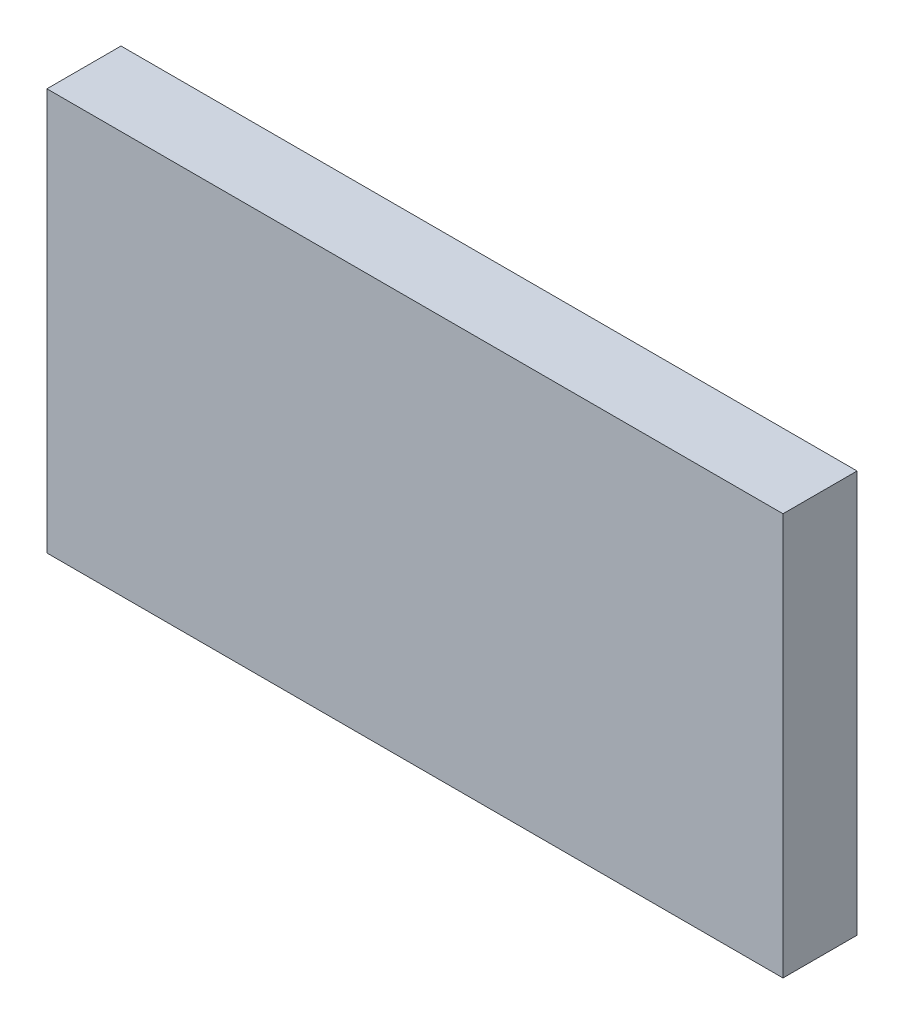
ISO-10303-21;
HEADER;
FILE_DESCRIPTION(('STEP AP214'),'2;1');
FILE_NAME('part.step','',(''),(''),'','','');
FILE_SCHEMA(('AUTOMOTIVE_DESIGN { 1 0 10303 214 1 1 1 1 }'));
ENDSEC;
DATA;
#1=APPLICATION_CONTEXT('core data for automotive mechanical design processes');
#2=APPLICATION_PROTOCOL_DEFINITION('international standard','automotive_design',2000,#1);
#3=PRODUCT_CONTEXT('',#1,'mechanical');
#4=PRODUCT('Part','Part','',(#3));
#5=PRODUCT_RELATED_PRODUCT_CATEGORY('part','',(#4));
#6=PRODUCT_DEFINITION_FORMATION('','',#4);
#7=PRODUCT_DEFINITION_CONTEXT('part definition',#1,'design');
#8=PRODUCT_DEFINITION('design','',#6,#7);
#9=PRODUCT_DEFINITION_SHAPE('','',#8);
#10=(LENGTH_UNIT() NAMED_UNIT(*) SI_UNIT(.MILLI.,.METRE.));
#11=(NAMED_UNIT(*) PLANE_ANGLE_UNIT() SI_UNIT($,.RADIAN.));
#12=(NAMED_UNIT(*) SI_UNIT($,.STERADIAN.) SOLID_ANGLE_UNIT());
#13=UNCERTAINTY_MEASURE_WITH_UNIT(LENGTH_MEASURE(1.E-05),#10,'distance_accuracy_value','');
#14=(GEOMETRIC_REPRESENTATION_CONTEXT(3) GLOBAL_UNCERTAINTY_ASSIGNED_CONTEXT((#13)) GLOBAL_UNIT_ASSIGNED_CONTEXT((#10,
#11,#12)) REPRESENTATION_CONTEXT('',''));
#15=CARTESIAN_POINT('',(0.,0.,0.));
#16=DIRECTION('',(0.,0.,1.));
#17=DIRECTION('',(1.,0.,0.));
#18=AXIS2_PLACEMENT_3D('',#15,#16,#17);
#19=CARTESIAN_POINT('',(76.962,42.037,-4.986));
#20=DIRECTION('',(1.,0.,0.));
#21=DIRECTION('',(0.,0.,-1.));
#22=AXIS2_PLACEMENT_3D('',#19,#20,#21);
#23=PLANE('',#22);
#24=DIRECTION('',(0.,0.,1.));
#25=VECTOR('',#24,1.);
#26=CARTESIAN_POINT('',(76.962,42.037,-4.986));
#27=LINE('',#26,#25);
#28=CARTESIAN_POINT('',(76.962,42.037,-4.986));
#29=VERTEX_POINT('',#28);
#30=CARTESIAN_POINT('',(76.962,42.037,10.508));
#31=VERTEX_POINT('',#30);
#32=EDGE_CURVE('E50',#29,#31,#27,.T.);
#33=ORIENTED_EDGE('',*,*,#32,.T.);
#34=DIRECTION('',(0.,1.,0.));
#35=VECTOR('',#34,1.);
#36=CARTESIAN_POINT('',(76.962,42.037,10.508));
#37=LINE('',#36,#35);
#38=CARTESIAN_POINT('',(76.962,-42.037,10.508));
#39=VERTEX_POINT('',#38);
#40=EDGE_CURVE('E87',#39,#31,#37,.T.);
#41=ORIENTED_EDGE('',*,*,#40,.F.);
#42=DIRECTION('',(0.,0.,1.));
#43=VECTOR('',#42,1.);
#44=CARTESIAN_POINT('',(76.962,-42.037,-4.986));
#45=LINE('',#44,#43);
#46=CARTESIAN_POINT('',(76.962,-42.037,-4.986));
#47=VERTEX_POINT('',#46);
#48=EDGE_CURVE('E12',#47,#39,#45,.T.);
#49=ORIENTED_EDGE('',*,*,#48,.F.);
#50=DIRECTION('',(0.,1.,0.));
#51=VECTOR('',#50,1.);
#52=CARTESIAN_POINT('',(76.962,42.037,-4.986));
#53=LINE('',#52,#51);
#54=EDGE_CURVE('E88',#47,#29,#53,.T.);
#55=ORIENTED_EDGE('',*,*,#54,.T.);
#56=EDGE_LOOP('',(#33,#41,#49,#55));
#57=FACE_BOUND('',#56,.T.);
#58=ADVANCED_FACE('F47',(#57),#23,.T.);
#59=CARTESIAN_POINT('',(-76.962,-42.037,-4.986));
#60=DIRECTION('',(0.,-1.,0.));
#61=DIRECTION('',(0.,0.,-1.));
#62=AXIS2_PLACEMENT_3D('',#59,#60,#61);
#63=PLANE('',#62);
#64=ORIENTED_EDGE('',*,*,#48,.T.);
#65=DIRECTION('',(1.,0.,0.));
#66=VECTOR('',#65,1.);
#67=CARTESIAN_POINT('',(-76.962,-42.037,10.508));
#68=LINE('',#67,#66);
#69=CARTESIAN_POINT('',(-76.962,-42.037,10.508));
#70=VERTEX_POINT('',#69);
#71=EDGE_CURVE('E104',#70,#39,#68,.T.);
#72=ORIENTED_EDGE('',*,*,#71,.F.);
#73=DIRECTION('',(0.,0.,1.));
#74=VECTOR('',#73,1.);
#75=CARTESIAN_POINT('',(-76.962,-42.037,-4.986));
#76=LINE('',#75,#74);
#77=CARTESIAN_POINT('',(-76.962,-42.037,-4.986));
#78=VERTEX_POINT('',#77);
#79=EDGE_CURVE('E55',#78,#70,#76,.T.);
#80=ORIENTED_EDGE('',*,*,#79,.F.);
#81=DIRECTION('',(1.,0.,0.));
#82=VECTOR('',#81,1.);
#83=CARTESIAN_POINT('',(-76.962,-42.037,-4.986));
#84=LINE('',#83,#82);
#85=EDGE_CURVE('E93',#78,#47,#84,.T.);
#86=ORIENTED_EDGE('',*,*,#85,.T.);
#87=EDGE_LOOP('',(#64,#72,#80,#86));
#88=FACE_BOUND('',#87,.T.);
#89=ADVANCED_FACE('F119',(#88),#63,.T.);
#90=CARTESIAN_POINT('',(-76.962,42.037,-4.986));
#91=DIRECTION('',(-1.,0.,0.));
#92=DIRECTION('',(0.,0.,1.));
#93=AXIS2_PLACEMENT_3D('',#90,#91,#92);
#94=PLANE('',#93);
#95=ORIENTED_EDGE('',*,*,#79,.T.);
#96=DIRECTION('',(0.,-1.,0.));
#97=VECTOR('',#96,1.);
#98=CARTESIAN_POINT('',(-76.962,42.037,10.508));
#99=LINE('',#98,#97);
#100=CARTESIAN_POINT('',(-76.962,42.037,10.508));
#101=VERTEX_POINT('',#100);
#102=EDGE_CURVE('E100',#101,#70,#99,.T.);
#103=ORIENTED_EDGE('',*,*,#102,.F.);
#104=DIRECTION('',(0.,0.,1.));
#105=VECTOR('',#104,1.);
#106=CARTESIAN_POINT('',(-76.962,42.037,-4.986));
#107=LINE('',#106,#105);
#108=CARTESIAN_POINT('',(-76.962,42.037,-4.986));
#109=VERTEX_POINT('',#108);
#110=EDGE_CURVE('E92',#109,#101,#107,.T.);
#111=ORIENTED_EDGE('',*,*,#110,.F.);
#112=DIRECTION('',(0.,-1.,0.));
#113=VECTOR('',#112,1.);
#114=CARTESIAN_POINT('',(-76.962,42.037,-4.986));
#115=LINE('',#114,#113);
#116=EDGE_CURVE('E112',#109,#78,#115,.T.);
#117=ORIENTED_EDGE('',*,*,#116,.T.);
#118=EDGE_LOOP('',(#95,#103,#111,#117));
#119=FACE_BOUND('',#118,.T.);
#120=ADVANCED_FACE('F116',(#119),#94,.T.);
#121=CARTESIAN_POINT('',(-76.962,42.037,-4.986));
#122=DIRECTION('',(0.,1.,0.));
#123=DIRECTION('',(0.,0.,1.));
#124=AXIS2_PLACEMENT_3D('',#121,#122,#123);
#125=PLANE('',#124);
#126=ORIENTED_EDGE('',*,*,#110,.T.);
#127=DIRECTION('',(-1.,0.,0.));
#128=VECTOR('',#127,1.);
#129=CARTESIAN_POINT('',(-76.962,42.037,10.508));
#130=LINE('',#129,#128);
#131=EDGE_CURVE('E95',#31,#101,#130,.T.);
#132=ORIENTED_EDGE('',*,*,#131,.F.);
#133=ORIENTED_EDGE('',*,*,#32,.F.);
#134=DIRECTION('',(-1.,0.,0.));
#135=VECTOR('',#134,1.);
#136=CARTESIAN_POINT('',(-76.962,42.037,-4.986));
#137=LINE('',#136,#135);
#138=EDGE_CURVE('E110',#29,#109,#137,.T.);
#139=ORIENTED_EDGE('',*,*,#138,.T.);
#140=EDGE_LOOP('',(#126,#132,#133,#139));
#141=FACE_BOUND('',#140,.T.);
#142=ADVANCED_FACE('F96',(#141),#125,.T.);
#143=CARTESIAN_POINT('',(0.,0.,-4.986));
#144=DIRECTION('',(0.,0.,1.));
#145=DIRECTION('',(1.,0.,0.));
#146=AXIS2_PLACEMENT_3D('',#143,#144,#145);
#147=PLANE('',#146);
#148=ORIENTED_EDGE('',*,*,#54,.F.);
#149=ORIENTED_EDGE('',*,*,#85,.F.);
#150=ORIENTED_EDGE('',*,*,#116,.F.);
#151=ORIENTED_EDGE('',*,*,#138,.F.);
#152=EDGE_LOOP('',(#148,#149,#150,#151));
#153=FACE_BOUND('',#152,.T.);
#154=ADVANCED_FACE('F121',(#153),#147,.F.);
#155=CARTESIAN_POINT('',(0.,0.,10.508));
#156=DIRECTION('',(0.,0.,1.));
#157=DIRECTION('',(1.,0.,0.));
#158=AXIS2_PLACEMENT_3D('',#155,#156,#157);
#159=PLANE('',#158);
#160=ORIENTED_EDGE('',*,*,#40,.T.);
#161=ORIENTED_EDGE('',*,*,#131,.T.);
#162=ORIENTED_EDGE('',*,*,#102,.T.);
#163=ORIENTED_EDGE('',*,*,#71,.T.);
#164=EDGE_LOOP('',(#160,#161,#162,#163));
#165=FACE_BOUND('',#164,.T.);
#166=ADVANCED_FACE('F103',(#165),#159,.T.);
#167=CLOSED_SHELL('',(#58,#89,#120,#142,#154,#166));
#168=MANIFOLD_SOLID_BREP('B2_NOT_SHOWN',#167);
#169=CARTESIAN_POINT('',(75.,40.,10.));
#170=DIRECTION('',(-1.,0.,0.));
#171=DIRECTION('',(0.,0.,1.));
#172=AXIS2_PLACEMENT_3D('',#169,#170,#171);
#173=PLANE('',#172);
#174=DIRECTION('',(0.,1.,0.));
#175=VECTOR('',#174,1.);
#176=CARTESIAN_POINT('',(75.,40.,10.));
#177=LINE('',#176,#175);
#178=CARTESIAN_POINT('',(75.,-37.,10.));
#179=VERTEX_POINT('',#178);
#180=CARTESIAN_POINT('',(75.,37.,10.));
#181=VERTEX_POINT('',#180);
#182=EDGE_CURVE('E349',#179,#181,#177,.T.);
#183=ORIENTED_EDGE('',*,*,#182,.F.);
#184=DIRECTION('',(0.,0.,-1.));
#185=VECTOR('',#184,1.);
#186=CARTESIAN_POINT('',(75.,-37.,10.));
#187=LINE('',#186,#185);
#188=CARTESIAN_POINT('',(75.,-37.,0.));
#189=VERTEX_POINT('',#188);
#190=EDGE_CURVE('E334',#179,#189,#187,.T.);
#191=ORIENTED_EDGE('',*,*,#190,.T.);
#192=DIRECTION('',(0.,1.,0.));
#193=VECTOR('',#192,1.);
#194=CARTESIAN_POINT('',(75.,40.,0.));
#195=LINE('',#194,#193);
#196=CARTESIAN_POINT('',(75.,37.,0.));
#197=VERTEX_POINT('',#196);
#198=EDGE_CURVE('E346',#189,#197,#195,.T.);
#199=ORIENTED_EDGE('',*,*,#198,.T.);
#200=DIRECTION('',(0.,0.,-1.));
#201=VECTOR('',#200,1.);
#202=CARTESIAN_POINT('',(75.,37.,10.));
#203=LINE('',#202,#201);
#204=EDGE_CURVE('E351',#197,#181,#203,.F.);
#205=ORIENTED_EDGE('',*,*,#204,.T.);
#206=EDGE_LOOP('',(#183,#191,#199,#205));
#207=FACE_BOUND('',#206,.T.);
#208=ADVANCED_FACE('F170',(#207),#173,.F.);
#209=CARTESIAN_POINT('',(-75.,40.,10.));
#210=DIRECTION('',(0.,-1.,0.));
#211=DIRECTION('',(0.,0.,-1.));
#212=AXIS2_PLACEMENT_3D('',#209,#210,#211);
#213=PLANE('',#212);
#214=DIRECTION('',(-1.,0.,0.));
#215=VECTOR('',#214,1.);
#216=CARTESIAN_POINT('',(-75.,40.,10.));
#217=LINE('',#216,#215);
#218=CARTESIAN_POINT('',(72.,40.,10.));
#219=VERTEX_POINT('',#218);
#220=CARTESIAN_POINT('',(-72.,40.,10.));
#221=VERTEX_POINT('',#220);
#222=EDGE_CURVE('E549',#219,#221,#217,.T.);
#223=ORIENTED_EDGE('',*,*,#222,.F.);
#224=DIRECTION('',(0.,0.,-1.));
#225=VECTOR('',#224,1.);
#226=CARTESIAN_POINT('',(72.,40.,10.));
#227=LINE('',#226,#225);
#228=CARTESIAN_POINT('',(72.,40.,0.));
#229=VERTEX_POINT('',#228);
#230=EDGE_CURVE('E390',#219,#229,#227,.T.);
#231=ORIENTED_EDGE('',*,*,#230,.T.);
#232=DIRECTION('',(-1.,0.,0.));
#233=VECTOR('',#232,1.);
#234=CARTESIAN_POINT('',(-75.,40.,0.));
#235=LINE('',#234,#233);
#236=CARTESIAN_POINT('',(-72.,40.,0.));
#237=VERTEX_POINT('',#236);
#238=EDGE_CURVE('E355',#229,#237,#235,.T.);
#239=ORIENTED_EDGE('',*,*,#238,.T.);
#240=DIRECTION('',(0.,0.,-1.));
#241=VECTOR('',#240,1.);
#242=CARTESIAN_POINT('',(-72.,40.,10.));
#243=LINE('',#242,#241);
#244=EDGE_CURVE('E388',#237,#221,#243,.F.);
#245=ORIENTED_EDGE('',*,*,#244,.T.);
#246=EDGE_LOOP('',(#223,#231,#239,#245));
#247=FACE_BOUND('',#246,.T.);
#248=ADVANCED_FACE('F574',(#247),#213,.F.);
#249=CARTESIAN_POINT('',(-75.,40.,10.));
#250=DIRECTION('',(1.,0.,0.));
#251=DIRECTION('',(0.,1.,0.));
#252=AXIS2_PLACEMENT_3D('',#249,#250,#251);
#253=PLANE('',#252);
#254=DIRECTION('',(0.,-1.,0.));
#255=VECTOR('',#254,1.);
#256=CARTESIAN_POINT('',(-75.,40.,10.));
#257=LINE('',#256,#255);
#258=CARTESIAN_POINT('',(-75.,37.,10.));
#259=VERTEX_POINT('',#258);
#260=CARTESIAN_POINT('',(-75.,-37.,10.));
#261=VERTEX_POINT('',#260);
#262=EDGE_CURVE('E551',#259,#261,#257,.T.);
#263=ORIENTED_EDGE('',*,*,#262,.F.);
#264=DIRECTION('',(0.,0.,-1.));
#265=VECTOR('',#264,1.);
#266=CARTESIAN_POINT('',(-75.,37.,10.));
#267=LINE('',#266,#265);
#268=CARTESIAN_POINT('',(-75.,37.,0.));
#269=VERTEX_POINT('',#268);
#270=EDGE_CURVE('E395',#259,#269,#267,.T.);
#271=ORIENTED_EDGE('',*,*,#270,.T.);
#272=DIRECTION('',(0.,-1.,0.));
#273=VECTOR('',#272,1.);
#274=CARTESIAN_POINT('',(-75.,40.,0.));
#275=LINE('',#274,#273);
#276=CARTESIAN_POINT('',(-75.,-37.,0.));
#277=VERTEX_POINT('',#276);
#278=EDGE_CURVE('E359',#269,#277,#275,.T.);
#279=ORIENTED_EDGE('',*,*,#278,.T.);
#280=DIRECTION('',(0.,0.,-1.));
#281=VECTOR('',#280,1.);
#282=CARTESIAN_POINT('',(-75.,-37.,10.));
#283=LINE('',#282,#281);
#284=EDGE_CURVE('E393',#277,#261,#283,.F.);
#285=ORIENTED_EDGE('',*,*,#284,.T.);
#286=EDGE_LOOP('',(#263,#271,#279,#285));
#287=FACE_BOUND('',#286,.T.);
#288=ADVANCED_FACE('F566',(#287),#253,.F.);
#289=CARTESIAN_POINT('',(-75.,-40.,10.));
#290=DIRECTION('',(0.,1.,0.));
#291=DIRECTION('',(0.,0.,1.));
#292=AXIS2_PLACEMENT_3D('',#289,#290,#291);
#293=PLANE('',#292);
#294=DIRECTION('',(1.,0.,0.));
#295=VECTOR('',#294,1.);
#296=CARTESIAN_POINT('',(-75.,-40.,0.));
#297=LINE('',#296,#295);
#298=CARTESIAN_POINT('',(-72.,-40.,0.));
#299=VERTEX_POINT('',#298);
#300=CARTESIAN_POINT('',(72.,-40.,0.));
#301=VERTEX_POINT('',#300);
#302=EDGE_CURVE('E370',#299,#301,#297,.T.);
#303=ORIENTED_EDGE('',*,*,#302,.T.);
#304=DIRECTION('',(0.,0.,-1.));
#305=VECTOR('',#304,1.);
#306=CARTESIAN_POINT('',(72.,-40.,10.));
#307=LINE('',#306,#305);
#308=CARTESIAN_POINT('',(72.,-40.,10.));
#309=VERTEX_POINT('',#308);
#310=EDGE_CURVE('E335',#301,#309,#307,.F.);
#311=ORIENTED_EDGE('',*,*,#310,.T.);
#312=DIRECTION('',(1.,0.,0.));
#313=VECTOR('',#312,1.);
#314=CARTESIAN_POINT('',(-75.,-40.,10.));
#315=LINE('',#314,#313);
#316=CARTESIAN_POINT('',(-72.,-40.,10.));
#317=VERTEX_POINT('',#316);
#318=EDGE_CURVE('E365',#317,#309,#315,.T.);
#319=ORIENTED_EDGE('',*,*,#318,.F.);
#320=DIRECTION('',(0.,0.,-1.));
#321=VECTOR('',#320,1.);
#322=CARTESIAN_POINT('',(-72.,-40.,10.));
#323=LINE('',#322,#321);
#324=EDGE_CURVE('E340',#317,#299,#323,.T.);
#325=ORIENTED_EDGE('',*,*,#324,.T.);
#326=EDGE_LOOP('',(#303,#311,#319,#325));
#327=FACE_BOUND('',#326,.T.);
#328=ADVANCED_FACE('F560',(#327),#293,.F.);
#329=CARTESIAN_POINT('',(0.,0.,10.));
#330=DIRECTION('',(0.,0.,1.));
#331=DIRECTION('',(1.,0.,0.));
#332=AXIS2_PLACEMENT_3D('',#329,#330,#331);
#333=PLANE('',#332);
#334=CARTESIAN_POINT('',(-70.,35.,10.));
#335=DIRECTION('',(0.,0.,-1.));
#336=DIRECTION('',(-1.,0.,0.));
#337=AXIS2_PLACEMENT_3D('',#334,#335,#336);
#338=CIRCLE('',#337,11.);
#339=CARTESIAN_POINT('',(-59.5431354294488,31.5862068965517,10.));
#340=VERTEX_POINT('',#339);
#341=CARTESIAN_POINT('',(-66.5862068965517,24.5431354294488,10.));
#342=VERTEX_POINT('',#341);
#343=EDGE_CURVE('E469',#340,#342,#338,.T.);
#344=ORIENTED_EDGE('',*,*,#343,.F.);
#345=CARTESIAN_POINT('',(-56.2159512479098,30.5,10.));
#346=DIRECTION('',(0.,0.,1.));
#347=DIRECTION('',(1.,0.,0.));
#348=AXIS2_PLACEMENT_3D('',#345,#346,#347);
#349=CIRCLE('',#348,3.5);
#350=CARTESIAN_POINT('',(-56.2159512479098,34.,10.));
#351=VERTEX_POINT('',#350);
#352=EDGE_CURVE('E178',#340,#351,#349,.F.);
#353=ORIENTED_EDGE('',*,*,#352,.T.);
#354=DIRECTION('',(-1.,0.,0.));
#355=VECTOR('',#354,1.);
#356=CARTESIAN_POINT('',(-59.0455488498967,34.,10.));
#357=LINE('',#356,#355);
#358=CARTESIAN_POINT('',(56.2159512479097,34.,10.));
#359=VERTEX_POINT('',#358);
#360=EDGE_CURVE('E468',#359,#351,#357,.T.);
#361=ORIENTED_EDGE('',*,*,#360,.F.);
#362=CARTESIAN_POINT('',(56.2159512479098,30.5,10.));
#363=DIRECTION('',(0.,0.,1.));
#364=DIRECTION('',(1.,0.,0.));
#365=AXIS2_PLACEMENT_3D('',#362,#363,#364);
#366=CIRCLE('',#365,3.5);
#367=CARTESIAN_POINT('',(59.5431354294488,31.5862068965517,10.));
#368=VERTEX_POINT('',#367);
#369=EDGE_CURVE('E463',#359,#368,#366,.F.);
#370=ORIENTED_EDGE('',*,*,#369,.T.);
#371=CARTESIAN_POINT('',(70.,35.,10.));
#372=DIRECTION('',(0.,0.,-1.));
#373=DIRECTION('',(1.,0.,0.));
#374=AXIS2_PLACEMENT_3D('',#371,#372,#373);
#375=CIRCLE('',#374,11.);
#376=CARTESIAN_POINT('',(66.5862068965517,24.5431354294488,10.));
#377=VERTEX_POINT('',#376);
#378=EDGE_CURVE('E476',#377,#368,#375,.T.);
#379=ORIENTED_EDGE('',*,*,#378,.F.);
#380=CARTESIAN_POINT('',(65.5,21.2159512479098,10.));
#381=DIRECTION('',(0.,0.,1.));
#382=DIRECTION('',(1.,0.,0.));
#383=AXIS2_PLACEMENT_3D('',#380,#381,#382);
#384=CIRCLE('',#383,3.5);
#385=CARTESIAN_POINT('',(69.,21.2159512479098,10.));
#386=VERTEX_POINT('',#385);
#387=EDGE_CURVE('E461',#377,#386,#384,.F.);
#388=ORIENTED_EDGE('',*,*,#387,.T.);
#389=DIRECTION('',(0.,1.,0.));
#390=VECTOR('',#389,1.);
#391=CARTESIAN_POINT('',(69.,24.0455488498967,10.));
#392=LINE('',#391,#390);
#393=CARTESIAN_POINT('',(69.,-21.2159512479098,10.));
#394=VERTEX_POINT('',#393);
#395=EDGE_CURVE('E524',#394,#386,#392,.T.);
#396=ORIENTED_EDGE('',*,*,#395,.F.);
#397=CARTESIAN_POINT('',(65.5,-21.2159512479098,10.));
#398=DIRECTION('',(0.,0.,1.));
#399=DIRECTION('',(1.,0.,0.));
#400=AXIS2_PLACEMENT_3D('',#397,#398,#399);
#401=CIRCLE('',#400,3.5);
#402=CARTESIAN_POINT('',(66.5862068965517,-24.5431354294488,10.));
#403=VERTEX_POINT('',#402);
#404=EDGE_CURVE('E459',#394,#403,#401,.F.);
#405=ORIENTED_EDGE('',*,*,#404,.T.);
#406=CARTESIAN_POINT('',(70.,-35.,10.));
#407=DIRECTION('',(0.,0.,-1.));
#408=DIRECTION('',(1.,0.,0.));
#409=AXIS2_PLACEMENT_3D('',#406,#407,#408);
#410=CIRCLE('',#409,11.);
#411=CARTESIAN_POINT('',(59.5431354294488,-31.5862068965517,10.));
#412=VERTEX_POINT('',#411);
#413=EDGE_CURVE('E521',#412,#403,#410,.T.);
#414=ORIENTED_EDGE('',*,*,#413,.F.);
#415=CARTESIAN_POINT('',(56.2159512479098,-30.5,10.));
#416=DIRECTION('',(0.,0.,1.));
#417=DIRECTION('',(1.,0.,0.));
#418=AXIS2_PLACEMENT_3D('',#415,#416,#417);
#419=CIRCLE('',#418,3.5);
#420=CARTESIAN_POINT('',(56.2159512479098,-34.,10.));
#421=VERTEX_POINT('',#420);
#422=EDGE_CURVE('E457',#412,#421,#419,.F.);
#423=ORIENTED_EDGE('',*,*,#422,.T.);
#424=DIRECTION('',(1.,0.,0.));
#425=VECTOR('',#424,1.);
#426=CARTESIAN_POINT('',(-59.0455488498967,-34.,10.));
#427=LINE('',#426,#425);
#428=CARTESIAN_POINT('',(-56.2159512479098,-34.,10.));
#429=VERTEX_POINT('',#428);
#430=EDGE_CURVE('E518',#429,#421,#427,.T.);
#431=ORIENTED_EDGE('',*,*,#430,.F.);
#432=CARTESIAN_POINT('',(-56.2159512479098,-30.5,10.));
#433=DIRECTION('',(0.,0.,1.));
#434=DIRECTION('',(1.,0.,0.));
#435=AXIS2_PLACEMENT_3D('',#432,#433,#434);
#436=CIRCLE('',#435,3.5);
#437=CARTESIAN_POINT('',(-59.5431354294488,-31.5862068965517,10.));
#438=VERTEX_POINT('',#437);
#439=EDGE_CURVE('E455',#429,#438,#436,.F.);
#440=ORIENTED_EDGE('',*,*,#439,.T.);
#441=CARTESIAN_POINT('',(-70.,-35.,10.));
#442=DIRECTION('',(0.,0.,-1.));
#443=DIRECTION('',(1.,0.,0.));
#444=AXIS2_PLACEMENT_3D('',#441,#442,#443);
#445=CIRCLE('',#444,11.);
#446=CARTESIAN_POINT('',(-66.5862068965517,-24.5431354294488,10.));
#447=VERTEX_POINT('',#446);
#448=EDGE_CURVE('E515',#447,#438,#445,.T.);
#449=ORIENTED_EDGE('',*,*,#448,.F.);
#450=CARTESIAN_POINT('',(-65.5,-21.2159512479098,10.));
#451=DIRECTION('',(0.,0.,1.));
#452=DIRECTION('',(1.,0.,0.));
#453=AXIS2_PLACEMENT_3D('',#450,#451,#452);
#454=CIRCLE('',#453,3.5);
#455=CARTESIAN_POINT('',(-69.,-21.2159512479098,10.));
#456=VERTEX_POINT('',#455);
#457=EDGE_CURVE('E453',#447,#456,#454,.F.);
#458=ORIENTED_EDGE('',*,*,#457,.T.);
#459=DIRECTION('',(0.,-1.,0.));
#460=VECTOR('',#459,1.);
#461=CARTESIAN_POINT('',(-69.,24.0455488498967,10.));
#462=LINE('',#461,#460);
#463=CARTESIAN_POINT('',(-69.,21.2159512479098,10.));
#464=VERTEX_POINT('',#463);
#465=EDGE_CURVE('E512',#464,#456,#462,.T.);
#466=ORIENTED_EDGE('',*,*,#465,.F.);
#467=CARTESIAN_POINT('',(-65.5,21.2159512479098,10.));
#468=DIRECTION('',(0.,0.,1.));
#469=DIRECTION('',(1.,0.,0.));
#470=AXIS2_PLACEMENT_3D('',#467,#468,#469);
#471=CIRCLE('',#470,3.5);
#472=EDGE_CURVE('E45',#464,#342,#471,.F.);
#473=ORIENTED_EDGE('',*,*,#472,.T.);
#474=EDGE_LOOP('',(#344,#353,#361,#370,#379,#388,#396,#405,#414,#423,#431,#440,#449,#458,#466,#473));
#475=FACE_BOUND('',#474,.T.);
#476=CARTESIAN_POINT('',(-70.,-35.,10.));
#477=DIRECTION('',(0.,0.,1.));
#478=DIRECTION('',(1.,0.,0.));
#479=AXIS2_PLACEMENT_3D('',#476,#477,#478);
#480=CIRCLE('',#479,2.49999999999999);
#481=CARTESIAN_POINT('',(-67.5,-35.,10.));
#482=VERTEX_POINT('',#481);
#483=EDGE_CURVE('E510',#482,#482,#480,.T.);
#484=ORIENTED_EDGE('',*,*,#483,.F.);
#485=EDGE_LOOP('',(#484));
#486=FACE_BOUND('',#485,.T.);
#487=CARTESIAN_POINT('',(-70.,35.,10.));
#488=DIRECTION('',(0.,0.,1.));
#489=DIRECTION('',(1.,0.,0.));
#490=AXIS2_PLACEMENT_3D('',#487,#488,#489);
#491=CIRCLE('',#490,2.49999999999999);
#492=CARTESIAN_POINT('',(-67.5,35.,10.));
#493=VERTEX_POINT('',#492);
#494=EDGE_CURVE('E534',#493,#493,#491,.T.);
#495=ORIENTED_EDGE('',*,*,#494,.F.);
#496=EDGE_LOOP('',(#495));
#497=FACE_BOUND('',#496,.T.);
#498=CARTESIAN_POINT('',(70.,35.,10.));
#499=DIRECTION('',(0.,0.,1.));
#500=DIRECTION('',(1.,0.,0.));
#501=AXIS2_PLACEMENT_3D('',#498,#499,#500);
#502=CIRCLE('',#501,2.49999999999999);
#503=CARTESIAN_POINT('',(72.5,35.,10.));
#504=VERTEX_POINT('',#503);
#505=EDGE_CURVE('E540',#504,#504,#502,.T.);
#506=ORIENTED_EDGE('',*,*,#505,.F.);
#507=EDGE_LOOP('',(#506));
#508=FACE_BOUND('',#507,.T.);
#509=CARTESIAN_POINT('',(70.,-35.,10.));
#510=DIRECTION('',(0.,0.,1.));
#511=DIRECTION('',(1.,0.,0.));
#512=AXIS2_PLACEMENT_3D('',#509,#510,#511);
#513=CIRCLE('',#512,2.49999999999999);
#514=CARTESIAN_POINT('',(72.5,-35.,10.));
#515=VERTEX_POINT('',#514);
#516=EDGE_CURVE('E362',#515,#515,#513,.T.);
#517=ORIENTED_EDGE('',*,*,#516,.F.);
#518=EDGE_LOOP('',(#517));
#519=FACE_BOUND('',#518,.T.);
#520=ORIENTED_EDGE('',*,*,#318,.T.);
#521=CARTESIAN_POINT('',(72.,-37.,10.));
#522=DIRECTION('',(0.,0.,1.));
#523=DIRECTION('',(1.,0.,0.));
#524=AXIS2_PLACEMENT_3D('',#521,#522,#523);
#525=CIRCLE('',#524,3.);
#526=EDGE_CURVE('E386',#309,#179,#525,.T.);
#527=ORIENTED_EDGE('',*,*,#526,.T.);
#528=ORIENTED_EDGE('',*,*,#182,.T.);
#529=CARTESIAN_POINT('',(72.,37.,10.));
#530=DIRECTION('',(0.,0.,1.));
#531=DIRECTION('',(1.,0.,0.));
#532=AXIS2_PLACEMENT_3D('',#529,#530,#531);
#533=CIRCLE('',#532,3.);
#534=EDGE_CURVE('E384',#181,#219,#533,.T.);
#535=ORIENTED_EDGE('',*,*,#534,.T.);
#536=ORIENTED_EDGE('',*,*,#222,.T.);
#537=CARTESIAN_POINT('',(-72.,37.,10.));
#538=DIRECTION('',(0.,0.,1.));
#539=DIRECTION('',(1.,0.,0.));
#540=AXIS2_PLACEMENT_3D('',#537,#538,#539);
#541=CIRCLE('',#540,3.);
#542=EDGE_CURVE('E382',#221,#259,#541,.T.);
#543=ORIENTED_EDGE('',*,*,#542,.T.);
#544=ORIENTED_EDGE('',*,*,#262,.T.);
#545=CARTESIAN_POINT('',(-72.,-37.,10.));
#546=DIRECTION('',(0.,0.,1.));
#547=DIRECTION('',(1.,0.,0.));
#548=AXIS2_PLACEMENT_3D('',#545,#546,#547);
#549=CIRCLE('',#548,3.);
#550=EDGE_CURVE('E380',#261,#317,#549,.T.);
#551=ORIENTED_EDGE('',*,*,#550,.T.);
#552=EDGE_LOOP('',(#520,#527,#528,#535,#536,#543,#544,#551));
#553=FACE_BOUND('',#552,.T.);
#554=ADVANCED_FACE('F466',(#475,#486,#497,#508,#519,#553),#333,.T.);
#555=CARTESIAN_POINT('',(0.,0.,0.));
#556=DIRECTION('',(0.,0.,1.));
#557=DIRECTION('',(1.,0.,0.));
#558=AXIS2_PLACEMENT_3D('',#555,#556,#557);
#559=PLANE('',#558);
#560=CARTESIAN_POINT('',(-70.,-35.,0.));
#561=DIRECTION('',(0.,0.,1.));
#562=DIRECTION('',(1.,0.,0.));
#563=AXIS2_PLACEMENT_3D('',#560,#561,#562);
#564=CIRCLE('',#563,2.5);
#565=CARTESIAN_POINT('',(-67.5,-35.,0.));
#566=VERTEX_POINT('',#565);
#567=EDGE_CURVE('E531',#566,#566,#564,.T.);
#568=ORIENTED_EDGE('',*,*,#567,.T.);
#569=EDGE_LOOP('',(#568));
#570=FACE_BOUND('',#569,.T.);
#571=CARTESIAN_POINT('',(-70.,35.,0.));
#572=DIRECTION('',(0.,0.,1.));
#573=DIRECTION('',(1.,0.,0.));
#574=AXIS2_PLACEMENT_3D('',#571,#572,#573);
#575=CIRCLE('',#574,2.5);
#576=CARTESIAN_POINT('',(-67.5,35.,0.));
#577=VERTEX_POINT('',#576);
#578=EDGE_CURVE('E537',#577,#577,#575,.T.);
#579=ORIENTED_EDGE('',*,*,#578,.T.);
#580=EDGE_LOOP('',(#579));
#581=FACE_BOUND('',#580,.T.);
#582=CARTESIAN_POINT('',(70.,35.,0.));
#583=DIRECTION('',(0.,0.,1.));
#584=DIRECTION('',(1.,0.,0.));
#585=AXIS2_PLACEMENT_3D('',#582,#583,#584);
#586=CIRCLE('',#585,2.5);
#587=CARTESIAN_POINT('',(72.5,35.,0.));
#588=VERTEX_POINT('',#587);
#589=EDGE_CURVE('E543',#588,#588,#586,.T.);
#590=ORIENTED_EDGE('',*,*,#589,.T.);
#591=EDGE_LOOP('',(#590));
#592=FACE_BOUND('',#591,.T.);
#593=CARTESIAN_POINT('',(70.,-35.,0.));
#594=DIRECTION('',(0.,0.,1.));
#595=DIRECTION('',(1.,0.,0.));
#596=AXIS2_PLACEMENT_3D('',#593,#594,#595);
#597=CIRCLE('',#596,2.5);
#598=CARTESIAN_POINT('',(72.5,-35.,0.));
#599=VERTEX_POINT('',#598);
#600=EDGE_CURVE('E356',#599,#599,#597,.T.);
#601=ORIENTED_EDGE('',*,*,#600,.T.);
#602=EDGE_LOOP('',(#601));
#603=FACE_BOUND('',#602,.T.);
#604=ORIENTED_EDGE('',*,*,#198,.F.);
#605=CARTESIAN_POINT('',(72.,-37.,0.));
#606=DIRECTION('',(0.,0.,1.));
#607=DIRECTION('',(1.,0.,0.));
#608=AXIS2_PLACEMENT_3D('',#605,#606,#607);
#609=CIRCLE('',#608,3.);
#610=EDGE_CURVE('E330',#189,#301,#609,.F.);
#611=ORIENTED_EDGE('',*,*,#610,.T.);
#612=ORIENTED_EDGE('',*,*,#302,.F.);
#613=CARTESIAN_POINT('',(-72.,-37.,0.));
#614=DIRECTION('',(0.,0.,1.));
#615=DIRECTION('',(1.,0.,0.));
#616=AXIS2_PLACEMENT_3D('',#613,#614,#615);
#617=CIRCLE('',#616,3.);
#618=EDGE_CURVE('E350',#299,#277,#617,.F.);
#619=ORIENTED_EDGE('',*,*,#618,.T.);
#620=ORIENTED_EDGE('',*,*,#278,.F.);
#621=CARTESIAN_POINT('',(-72.,37.,0.));
#622=DIRECTION('',(0.,0.,1.));
#623=DIRECTION('',(1.,0.,0.));
#624=AXIS2_PLACEMENT_3D('',#621,#622,#623);
#625=CIRCLE('',#624,3.);
#626=EDGE_CURVE('E374',#269,#237,#625,.F.);
#627=ORIENTED_EDGE('',*,*,#626,.T.);
#628=ORIENTED_EDGE('',*,*,#238,.F.);
#629=CARTESIAN_POINT('',(72.,37.,0.));
#630=DIRECTION('',(0.,0.,1.));
#631=DIRECTION('',(1.,0.,0.));
#632=AXIS2_PLACEMENT_3D('',#629,#630,#631);
#633=CIRCLE('',#632,3.);
#634=EDGE_CURVE('E341',#229,#197,#633,.F.);
#635=ORIENTED_EDGE('',*,*,#634,.T.);
#636=EDGE_LOOP('',(#604,#611,#612,#619,#620,#627,#628,#635));
#637=FACE_BOUND('',#636,.T.);
#638=ADVANCED_FACE('F353',(#570,#581,#592,#603,#637),#559,.F.);
#639=CARTESIAN_POINT('',(72.,-37.,10.));
#640=DIRECTION('',(0.,0.,-1.));
#641=DIRECTION('',(-1.,0.,0.));
#642=AXIS2_PLACEMENT_3D('',#639,#640,#641);
#643=CYLINDRICAL_SURFACE('',#642,3.);
#644=ORIENTED_EDGE('',*,*,#526,.F.);
#645=ORIENTED_EDGE('',*,*,#310,.F.);
#646=ORIENTED_EDGE('',*,*,#610,.F.);
#647=ORIENTED_EDGE('',*,*,#190,.F.);
#648=EDGE_LOOP('',(#644,#645,#646,#647));
#649=FACE_BOUND('',#648,.T.);
#650=ADVANCED_FACE('F333',(#649),#643,.T.);
#651=CARTESIAN_POINT('',(72.,37.,10.));
#652=DIRECTION('',(0.,0.,-1.));
#653=DIRECTION('',(-1.,0.,0.));
#654=AXIS2_PLACEMENT_3D('',#651,#652,#653);
#655=CYLINDRICAL_SURFACE('',#654,3.);
#656=ORIENTED_EDGE('',*,*,#534,.F.);
#657=ORIENTED_EDGE('',*,*,#204,.F.);
#658=ORIENTED_EDGE('',*,*,#634,.F.);
#659=ORIENTED_EDGE('',*,*,#230,.F.);
#660=EDGE_LOOP('',(#656,#657,#658,#659));
#661=FACE_BOUND('',#660,.T.);
#662=ADVANCED_FACE('F578',(#661),#655,.T.);
#663=CARTESIAN_POINT('',(-72.,37.,10.));
#664=DIRECTION('',(0.,0.,-1.));
#665=DIRECTION('',(-1.,0.,0.));
#666=AXIS2_PLACEMENT_3D('',#663,#664,#665);
#667=CYLINDRICAL_SURFACE('',#666,3.);
#668=ORIENTED_EDGE('',*,*,#542,.F.);
#669=ORIENTED_EDGE('',*,*,#244,.F.);
#670=ORIENTED_EDGE('',*,*,#626,.F.);
#671=ORIENTED_EDGE('',*,*,#270,.F.);
#672=EDGE_LOOP('',(#668,#669,#670,#671));
#673=FACE_BOUND('',#672,.T.);
#674=ADVANCED_FACE('F570',(#673),#667,.T.);
#675=CARTESIAN_POINT('',(-72.,-37.,10.));
#676=DIRECTION('',(0.,0.,-1.));
#677=DIRECTION('',(-1.,0.,0.));
#678=AXIS2_PLACEMENT_3D('',#675,#676,#677);
#679=CYLINDRICAL_SURFACE('',#678,3.);
#680=ORIENTED_EDGE('',*,*,#550,.F.);
#681=ORIENTED_EDGE('',*,*,#284,.F.);
#682=ORIENTED_EDGE('',*,*,#618,.F.);
#683=ORIENTED_EDGE('',*,*,#324,.F.);
#684=EDGE_LOOP('',(#680,#681,#682,#683));
#685=FACE_BOUND('',#684,.T.);
#686=ADVANCED_FACE('F562',(#685),#679,.T.);
#687=CARTESIAN_POINT('',(70.,-35.,10.));
#688=DIRECTION('',(0.,0.,1.));
#689=DIRECTION('',(1.,0.,0.));
#690=AXIS2_PLACEMENT_3D('',#687,#688,#689);
#691=CYLINDRICAL_SURFACE('',#690,2.5);
#692=ORIENTED_EDGE('',*,*,#600,.F.);
#693=EDGE_LOOP('',(#692));
#694=FACE_BOUND('',#693,.T.);
#695=ORIENTED_EDGE('',*,*,#516,.T.);
#696=EDGE_LOOP('',(#695));
#697=FACE_BOUND('',#696,.T.);
#698=ADVANCED_FACE('F603',(#694,#697),#691,.F.);
#699=CARTESIAN_POINT('',(70.,35.,10.));
#700=DIRECTION('',(0.,0.,1.));
#701=DIRECTION('',(1.,0.,0.));
#702=AXIS2_PLACEMENT_3D('',#699,#700,#701);
#703=CYLINDRICAL_SURFACE('',#702,2.5);
#704=ORIENTED_EDGE('',*,*,#589,.F.);
#705=EDGE_LOOP('',(#704));
#706=FACE_BOUND('',#705,.T.);
#707=ORIENTED_EDGE('',*,*,#505,.T.);
#708=EDGE_LOOP('',(#707));
#709=FACE_BOUND('',#708,.T.);
#710=ADVANCED_FACE('F606',(#706,#709),#703,.F.);
#711=CARTESIAN_POINT('',(-70.,35.,10.));
#712=DIRECTION('',(0.,0.,1.));
#713=DIRECTION('',(1.,0.,0.));
#714=AXIS2_PLACEMENT_3D('',#711,#712,#713);
#715=CYLINDRICAL_SURFACE('',#714,2.5);
#716=ORIENTED_EDGE('',*,*,#578,.F.);
#717=EDGE_LOOP('',(#716));
#718=FACE_BOUND('',#717,.T.);
#719=ORIENTED_EDGE('',*,*,#494,.T.);
#720=EDGE_LOOP('',(#719));
#721=FACE_BOUND('',#720,.T.);
#722=ADVANCED_FACE('F610',(#718,#721),#715,.F.);
#723=CARTESIAN_POINT('',(-70.,-35.,10.));
#724=DIRECTION('',(0.,0.,1.));
#725=DIRECTION('',(1.,0.,0.));
#726=AXIS2_PLACEMENT_3D('',#723,#724,#725);
#727=CYLINDRICAL_SURFACE('',#726,2.5);
#728=ORIENTED_EDGE('',*,*,#567,.F.);
#729=EDGE_LOOP('',(#728));
#730=FACE_BOUND('',#729,.T.);
#731=ORIENTED_EDGE('',*,*,#483,.T.);
#732=EDGE_LOOP('',(#731));
#733=FACE_BOUND('',#732,.T.);
#734=ADVANCED_FACE('F614',(#730,#733),#727,.F.);
#735=CARTESIAN_POINT('',(-70.,35.,2.));
#736=DIRECTION('',(0.,0.,1.));
#737=DIRECTION('',(1.,0.,0.));
#738=AXIS2_PLACEMENT_3D('',#735,#736,#737);
#739=CYLINDRICAL_SURFACE('',#738,11.);
#740=CARTESIAN_POINT('',(-70.,35.,2.));
#741=DIRECTION('',(0.,0.,-1.));
#742=DIRECTION('',(-1.,0.,0.));
#743=AXIS2_PLACEMENT_3D('',#740,#741,#742);
#744=CIRCLE('',#743,11.);
#745=CARTESIAN_POINT('',(-59.5431354294488,31.5862068965517,2.));
#746=VERTEX_POINT('',#745);
#747=CARTESIAN_POINT('',(-66.5862068965517,24.5431354294488,2.));
#748=VERTEX_POINT('',#747);
#749=EDGE_CURVE('E475',#746,#748,#744,.T.);
#750=ORIENTED_EDGE('',*,*,#749,.F.);
#751=DIRECTION('',(0.,0.,1.));
#752=VECTOR('',#751,1.);
#753=CARTESIAN_POINT('',(-59.5431354294488,31.5862068965517,2.));
#754=LINE('',#753,#752);
#755=EDGE_CURVE('E451',#746,#340,#754,.T.);
#756=ORIENTED_EDGE('',*,*,#755,.T.);
#757=ORIENTED_EDGE('',*,*,#343,.T.);
#758=DIRECTION('',(0.,0.,1.));
#759=VECTOR('',#758,1.);
#760=CARTESIAN_POINT('',(-66.5862068965517,24.5431354294488,2.));
#761=LINE('',#760,#759);
#762=EDGE_CURVE('E449',#342,#748,#761,.F.);
#763=ORIENTED_EDGE('',*,*,#762,.T.);
#764=EDGE_LOOP('',(#750,#756,#757,#763));
#765=FACE_BOUND('',#764,.T.);
#766=ADVANCED_FACE('F488',(#765),#739,.T.);
#767=CARTESIAN_POINT('',(-59.0455488498967,34.,2.));
#768=DIRECTION('',(0.,1.,0.));
#769=DIRECTION('',(0.,0.,1.));
#770=AXIS2_PLACEMENT_3D('',#767,#768,#769);
#771=PLANE('',#770);
#772=DIRECTION('',(-1.,0.,0.));
#773=VECTOR('',#772,1.);
#774=CARTESIAN_POINT('',(-59.0455488498967,34.,2.));
#775=LINE('',#774,#773);
#776=CARTESIAN_POINT('',(56.2159512479097,34.,2.));
#777=VERTEX_POINT('',#776);
#778=CARTESIAN_POINT('',(-56.2159512479098,34.,2.));
#779=VERTEX_POINT('',#778);
#780=EDGE_CURVE('E486',#777,#779,#775,.T.);
#781=ORIENTED_EDGE('',*,*,#780,.F.);
#782=DIRECTION('',(0.,0.,-1.));
#783=VECTOR('',#782,1.);
#784=CARTESIAN_POINT('',(56.2159512479098,34.,10.));
#785=LINE('',#784,#783);
#786=EDGE_CURVE('E446',#777,#359,#785,.F.);
#787=ORIENTED_EDGE('',*,*,#786,.T.);
#788=ORIENTED_EDGE('',*,*,#360,.T.);
#789=DIRECTION('',(0.,0.,-1.));
#790=VECTOR('',#789,1.);
#791=CARTESIAN_POINT('',(-56.2159512479098,34.,2.));
#792=LINE('',#791,#790);
#793=EDGE_CURVE('E444',#351,#779,#792,.T.);
#794=ORIENTED_EDGE('',*,*,#793,.T.);
#795=EDGE_LOOP('',(#781,#787,#788,#794));
#796=FACE_BOUND('',#795,.T.);
#797=ADVANCED_FACE('F472',(#796),#771,.F.);
#798=CARTESIAN_POINT('',(70.,35.,2.));
#799=DIRECTION('',(0.,0.,1.));
#800=DIRECTION('',(1.,0.,0.));
#801=AXIS2_PLACEMENT_3D('',#798,#799,#800);
#802=CYLINDRICAL_SURFACE('',#801,11.);
#803=CARTESIAN_POINT('',(70.,35.,2.));
#804=DIRECTION('',(0.,0.,-1.));
#805=DIRECTION('',(1.,0.,0.));
#806=AXIS2_PLACEMENT_3D('',#803,#804,#805);
#807=CIRCLE('',#806,11.);
#808=CARTESIAN_POINT('',(66.5862068965517,24.5431354294488,2.));
#809=VERTEX_POINT('',#808);
#810=CARTESIAN_POINT('',(59.5431354294488,31.5862068965517,2.));
#811=VERTEX_POINT('',#810);
#812=EDGE_CURVE('E506',#809,#811,#807,.T.);
#813=ORIENTED_EDGE('',*,*,#812,.F.);
#814=DIRECTION('',(0.,0.,1.));
#815=VECTOR('',#814,1.);
#816=CARTESIAN_POINT('',(66.5862068965517,24.5431354294488,2.));
#817=LINE('',#816,#815);
#818=EDGE_CURVE('E441',#809,#377,#817,.T.);
#819=ORIENTED_EDGE('',*,*,#818,.T.);
#820=ORIENTED_EDGE('',*,*,#378,.T.);
#821=DIRECTION('',(0.,0.,1.));
#822=VECTOR('',#821,1.);
#823=CARTESIAN_POINT('',(59.5431354294488,31.5862068965517,2.));
#824=LINE('',#823,#822);
#825=EDGE_CURVE('E439',#368,#811,#824,.F.);
#826=ORIENTED_EDGE('',*,*,#825,.T.);
#827=EDGE_LOOP('',(#813,#819,#820,#826));
#828=FACE_BOUND('',#827,.T.);
#829=ADVANCED_FACE('F640',(#828),#802,.T.);
#830=CARTESIAN_POINT('',(69.,24.0455488498967,2.));
#831=DIRECTION('',(1.,0.,0.));
#832=DIRECTION('',(0.,0.,-1.));
#833=AXIS2_PLACEMENT_3D('',#830,#831,#832);
#834=PLANE('',#833);
#835=DIRECTION('',(0.,1.,0.));
#836=VECTOR('',#835,1.);
#837=CARTESIAN_POINT('',(69.,24.0455488498967,2.));
#838=LINE('',#837,#836);
#839=CARTESIAN_POINT('',(69.,-21.2159512479098,2.));
#840=VERTEX_POINT('',#839);
#841=CARTESIAN_POINT('',(69.,21.2159512479098,2.));
#842=VERTEX_POINT('',#841);
#843=EDGE_CURVE('E503',#840,#842,#838,.T.);
#844=ORIENTED_EDGE('',*,*,#843,.F.);
#845=DIRECTION('',(0.,0.,-1.));
#846=VECTOR('',#845,1.);
#847=CARTESIAN_POINT('',(69.,-21.2159512479098,10.));
#848=LINE('',#847,#846);
#849=EDGE_CURVE('E436',#840,#394,#848,.F.);
#850=ORIENTED_EDGE('',*,*,#849,.T.);
#851=ORIENTED_EDGE('',*,*,#395,.T.);
#852=DIRECTION('',(0.,0.,-1.));
#853=VECTOR('',#852,1.);
#854=CARTESIAN_POINT('',(69.,21.2159512479098,2.));
#855=LINE('',#854,#853);
#856=EDGE_CURVE('E434',#386,#842,#855,.T.);
#857=ORIENTED_EDGE('',*,*,#856,.T.);
#858=EDGE_LOOP('',(#844,#850,#851,#857));
#859=FACE_BOUND('',#858,.T.);
#860=ADVANCED_FACE('F636',(#859),#834,.F.);
#861=CARTESIAN_POINT('',(70.,-35.,2.));
#862=DIRECTION('',(0.,0.,1.));
#863=DIRECTION('',(1.,0.,0.));
#864=AXIS2_PLACEMENT_3D('',#861,#862,#863);
#865=CYLINDRICAL_SURFACE('',#864,11.);
#866=CARTESIAN_POINT('',(70.,-35.,2.));
#867=DIRECTION('',(0.,0.,-1.));
#868=DIRECTION('',(1.,0.,0.));
#869=AXIS2_PLACEMENT_3D('',#866,#867,#868);
#870=CIRCLE('',#869,11.);
#871=CARTESIAN_POINT('',(59.5431354294488,-31.5862068965517,2.));
#872=VERTEX_POINT('',#871);
#873=CARTESIAN_POINT('',(66.5862068965517,-24.5431354294488,2.));
#874=VERTEX_POINT('',#873);
#875=EDGE_CURVE('E500',#872,#874,#870,.T.);
#876=ORIENTED_EDGE('',*,*,#875,.F.);
#877=DIRECTION('',(0.,0.,1.));
#878=VECTOR('',#877,1.);
#879=CARTESIAN_POINT('',(59.5431354294488,-31.5862068965517,2.));
#880=LINE('',#879,#878);
#881=EDGE_CURVE('E431',#872,#412,#880,.T.);
#882=ORIENTED_EDGE('',*,*,#881,.T.);
#883=ORIENTED_EDGE('',*,*,#413,.T.);
#884=DIRECTION('',(0.,0.,1.));
#885=VECTOR('',#884,1.);
#886=CARTESIAN_POINT('',(66.5862068965517,-24.5431354294488,2.));
#887=LINE('',#886,#885);
#888=EDGE_CURVE('E429',#403,#874,#887,.F.);
#889=ORIENTED_EDGE('',*,*,#888,.T.);
#890=EDGE_LOOP('',(#876,#882,#883,#889));
#891=FACE_BOUND('',#890,.T.);
#892=ADVANCED_FACE('F632',(#891),#865,.T.);
#893=CARTESIAN_POINT('',(-59.0455488498967,-34.,2.));
#894=DIRECTION('',(0.,-1.,0.));
#895=DIRECTION('',(1.,0.,0.));
#896=AXIS2_PLACEMENT_3D('',#893,#894,#895);
#897=PLANE('',#896);
#898=DIRECTION('',(1.,0.,0.));
#899=VECTOR('',#898,1.);
#900=CARTESIAN_POINT('',(-59.0455488498967,-34.,2.));
#901=LINE('',#900,#899);
#902=CARTESIAN_POINT('',(-56.2159512479098,-34.,2.));
#903=VERTEX_POINT('',#902);
#904=CARTESIAN_POINT('',(56.2159512479098,-34.,2.));
#905=VERTEX_POINT('',#904);
#906=EDGE_CURVE('E497',#903,#905,#901,.T.);
#907=ORIENTED_EDGE('',*,*,#906,.F.);
#908=DIRECTION('',(0.,0.,-1.));
#909=VECTOR('',#908,1.);
#910=CARTESIAN_POINT('',(-56.2159512479098,-34.,10.));
#911=LINE('',#910,#909);
#912=EDGE_CURVE('E426',#903,#429,#911,.F.);
#913=ORIENTED_EDGE('',*,*,#912,.T.);
#914=ORIENTED_EDGE('',*,*,#430,.T.);
#915=DIRECTION('',(0.,0.,-1.));
#916=VECTOR('',#915,1.);
#917=CARTESIAN_POINT('',(56.2159512479098,-34.,2.));
#918=LINE('',#917,#916);
#919=EDGE_CURVE('E424',#421,#905,#918,.T.);
#920=ORIENTED_EDGE('',*,*,#919,.T.);
#921=EDGE_LOOP('',(#907,#913,#914,#920));
#922=FACE_BOUND('',#921,.T.);
#923=ADVANCED_FACE('F628',(#922),#897,.F.);
#924=CARTESIAN_POINT('',(-70.,-35.,2.));
#925=DIRECTION('',(0.,0.,1.));
#926=DIRECTION('',(1.,0.,0.));
#927=AXIS2_PLACEMENT_3D('',#924,#925,#926);
#928=CYLINDRICAL_SURFACE('',#927,11.);
#929=CARTESIAN_POINT('',(-70.,-35.,2.));
#930=DIRECTION('',(0.,0.,-1.));
#931=DIRECTION('',(1.,0.,0.));
#932=AXIS2_PLACEMENT_3D('',#929,#930,#931);
#933=CIRCLE('',#932,11.);
#934=CARTESIAN_POINT('',(-66.5862068965517,-24.5431354294488,2.));
#935=VERTEX_POINT('',#934);
#936=CARTESIAN_POINT('',(-59.5431354294488,-31.5862068965517,2.));
#937=VERTEX_POINT('',#936);
#938=EDGE_CURVE('E492',#935,#937,#933,.T.);
#939=ORIENTED_EDGE('',*,*,#938,.F.);
#940=DIRECTION('',(0.,0.,1.));
#941=VECTOR('',#940,1.);
#942=CARTESIAN_POINT('',(-66.5862068965517,-24.5431354294488,2.));
#943=LINE('',#942,#941);
#944=EDGE_CURVE('E400',#935,#447,#943,.T.);
#945=ORIENTED_EDGE('',*,*,#944,.T.);
#946=ORIENTED_EDGE('',*,*,#448,.T.);
#947=DIRECTION('',(0.,0.,1.));
#948=VECTOR('',#947,1.);
#949=CARTESIAN_POINT('',(-59.5431354294488,-31.5862068965517,2.));
#950=LINE('',#949,#948);
#951=EDGE_CURVE('E398',#438,#937,#950,.F.);
#952=ORIENTED_EDGE('',*,*,#951,.T.);
#953=EDGE_LOOP('',(#939,#945,#946,#952));
#954=FACE_BOUND('',#953,.T.);
#955=ADVANCED_FACE('F624',(#954),#928,.T.);
#956=CARTESIAN_POINT('',(-69.,24.0455488498967,2.));
#957=DIRECTION('',(-1.,0.,0.));
#958=DIRECTION('',(0.,0.,1.));
#959=AXIS2_PLACEMENT_3D('',#956,#957,#958);
#960=PLANE('',#959);
#961=ORIENTED_EDGE('',*,*,#465,.T.);
#962=DIRECTION('',(0.,0.,-1.));
#963=VECTOR('',#962,1.);
#964=CARTESIAN_POINT('',(-69.,-21.2159512479098,2.));
#965=LINE('',#964,#963);
#966=CARTESIAN_POINT('',(-69.,-21.2159512479098,2.));
#967=VERTEX_POINT('',#966);
#968=EDGE_CURVE('E406',#456,#967,#965,.T.);
#969=ORIENTED_EDGE('',*,*,#968,.T.);
#970=DIRECTION('',(0.,-1.,0.));
#971=VECTOR('',#970,1.);
#972=CARTESIAN_POINT('',(-69.,24.0455488498967,2.));
#973=LINE('',#972,#971);
#974=CARTESIAN_POINT('',(-69.,21.2159512479098,2.));
#975=VERTEX_POINT('',#974);
#976=EDGE_CURVE('E490',#975,#967,#973,.T.);
#977=ORIENTED_EDGE('',*,*,#976,.F.);
#978=DIRECTION('',(0.,0.,-1.));
#979=VECTOR('',#978,1.);
#980=CARTESIAN_POINT('',(-69.,21.2159512479098,10.));
#981=LINE('',#980,#979);
#982=EDGE_CURVE('E403',#975,#464,#981,.F.);
#983=ORIENTED_EDGE('',*,*,#982,.T.);
#984=EDGE_LOOP('',(#961,#969,#977,#983));
#985=FACE_BOUND('',#984,.T.);
#986=ADVANCED_FACE('F621',(#985),#960,.F.);
#987=CARTESIAN_POINT('',(-70.,35.,2.));
#988=DIRECTION('',(0.,0.,-1.));
#989=DIRECTION('',(-1.,0.,0.));
#990=AXIS2_PLACEMENT_3D('',#987,#988,#989);
#991=PLANE('',#990);
#992=ORIENTED_EDGE('',*,*,#976,.T.);
#993=CARTESIAN_POINT('',(-65.5,-21.2159512479098,2.));
#994=DIRECTION('',(0.,0.,-1.));
#995=DIRECTION('',(-1.,0.,0.));
#996=AXIS2_PLACEMENT_3D('',#993,#994,#995);
#997=CIRCLE('',#996,3.5);
#998=EDGE_CURVE('E422',#967,#935,#997,.F.);
#999=ORIENTED_EDGE('',*,*,#998,.T.);
#1000=ORIENTED_EDGE('',*,*,#938,.T.);
#1001=CARTESIAN_POINT('',(-56.2159512479098,-30.5,2.));
#1002=DIRECTION('',(0.,0.,-1.));
#1003=DIRECTION('',(-1.,0.,0.));
#1004=AXIS2_PLACEMENT_3D('',#1001,#1002,#1003);
#1005=CIRCLE('',#1004,3.5);
#1006=EDGE_CURVE('E420',#937,#903,#1005,.F.);
#1007=ORIENTED_EDGE('',*,*,#1006,.T.);
#1008=ORIENTED_EDGE('',*,*,#906,.T.);
#1009=CARTESIAN_POINT('',(56.2159512479098,-30.5,2.));
#1010=DIRECTION('',(0.,0.,-1.));
#1011=DIRECTION('',(-1.,0.,0.));
#1012=AXIS2_PLACEMENT_3D('',#1009,#1010,#1011);
#1013=CIRCLE('',#1012,3.5);
#1014=EDGE_CURVE('E418',#905,#872,#1013,.F.);
#1015=ORIENTED_EDGE('',*,*,#1014,.T.);
#1016=ORIENTED_EDGE('',*,*,#875,.T.);
#1017=CARTESIAN_POINT('',(65.5,-21.2159512479098,2.));
#1018=DIRECTION('',(0.,0.,-1.));
#1019=DIRECTION('',(-1.,0.,0.));
#1020=AXIS2_PLACEMENT_3D('',#1017,#1018,#1019);
#1021=CIRCLE('',#1020,3.5);
#1022=EDGE_CURVE('E416',#874,#840,#1021,.F.);
#1023=ORIENTED_EDGE('',*,*,#1022,.T.);
#1024=ORIENTED_EDGE('',*,*,#843,.T.);
#1025=CARTESIAN_POINT('',(65.5,21.2159512479098,2.));
#1026=DIRECTION('',(0.,0.,-1.));
#1027=DIRECTION('',(-1.,0.,0.));
#1028=AXIS2_PLACEMENT_3D('',#1025,#1026,#1027);
#1029=CIRCLE('',#1028,3.5);
#1030=EDGE_CURVE('E414',#842,#809,#1029,.F.);
#1031=ORIENTED_EDGE('',*,*,#1030,.T.);
#1032=ORIENTED_EDGE('',*,*,#812,.T.);
#1033=CARTESIAN_POINT('',(56.2159512479098,30.5,2.));
#1034=DIRECTION('',(0.,0.,-1.));
#1035=DIRECTION('',(-1.,0.,0.));
#1036=AXIS2_PLACEMENT_3D('',#1033,#1034,#1035);
#1037=CIRCLE('',#1036,3.5);
#1038=EDGE_CURVE('E412',#811,#777,#1037,.F.);
#1039=ORIENTED_EDGE('',*,*,#1038,.T.);
#1040=ORIENTED_EDGE('',*,*,#780,.T.);
#1041=CARTESIAN_POINT('',(-56.2159512479098,30.5,2.));
#1042=DIRECTION('',(0.,0.,-1.));
#1043=DIRECTION('',(-1.,0.,0.));
#1044=AXIS2_PLACEMENT_3D('',#1041,#1042,#1043);
#1045=CIRCLE('',#1044,3.5);
#1046=EDGE_CURVE('E410',#779,#746,#1045,.F.);
#1047=ORIENTED_EDGE('',*,*,#1046,.T.);
#1048=ORIENTED_EDGE('',*,*,#749,.T.);
#1049=CARTESIAN_POINT('',(-65.5,21.2159512479098,2.));
#1050=DIRECTION('',(0.,0.,-1.));
#1051=DIRECTION('',(-1.,0.,0.));
#1052=AXIS2_PLACEMENT_3D('',#1049,#1050,#1051);
#1053=CIRCLE('',#1052,3.5);
#1054=EDGE_CURVE('E408',#748,#975,#1053,.F.);
#1055=ORIENTED_EDGE('',*,*,#1054,.T.);
#1056=EDGE_LOOP('',(#992,#999,#1000,#1007,#1008,#1015,#1016,#1023,#1024,#1031,#1032,#1039,#1040,
#1047,#1048,#1055));
#1057=FACE_BOUND('',#1056,.T.);
#1058=ADVANCED_FACE('F484',(#1057),#991,.F.);
#1059=CARTESIAN_POINT('',(-65.5,-21.2159512479098,2.));
#1060=DIRECTION('',(0.,0.,1.));
#1061=DIRECTION('',(1.,0.,0.));
#1062=AXIS2_PLACEMENT_3D('',#1059,#1060,#1061);
#1063=CYLINDRICAL_SURFACE('',#1062,3.5);
#1064=ORIENTED_EDGE('',*,*,#998,.F.);
#1065=ORIENTED_EDGE('',*,*,#968,.F.);
#1066=ORIENTED_EDGE('',*,*,#457,.F.);
#1067=ORIENTED_EDGE('',*,*,#944,.F.);
#1068=EDGE_LOOP('',(#1064,#1065,#1066,#1067));
#1069=FACE_BOUND('',#1068,.T.);
#1070=ADVANCED_FACE('F648',(#1069),#1063,.F.);
#1071=CARTESIAN_POINT('',(-56.2159512479098,-30.5,2.));
#1072=DIRECTION('',(0.,0.,1.));
#1073=DIRECTION('',(1.,0.,0.));
#1074=AXIS2_PLACEMENT_3D('',#1071,#1072,#1073);
#1075=CYLINDRICAL_SURFACE('',#1074,3.5);
#1076=ORIENTED_EDGE('',*,*,#1006,.F.);
#1077=ORIENTED_EDGE('',*,*,#951,.F.);
#1078=ORIENTED_EDGE('',*,*,#439,.F.);
#1079=ORIENTED_EDGE('',*,*,#912,.F.);
#1080=EDGE_LOOP('',(#1076,#1077,#1078,#1079));
#1081=FACE_BOUND('',#1080,.T.);
#1082=ADVANCED_FACE('F652',(#1081),#1075,.F.);
#1083=CARTESIAN_POINT('',(56.2159512479098,-30.5,2.));
#1084=DIRECTION('',(0.,0.,1.));
#1085=DIRECTION('',(1.,0.,0.));
#1086=AXIS2_PLACEMENT_3D('',#1083,#1084,#1085);
#1087=CYLINDRICAL_SURFACE('',#1086,3.5);
#1088=ORIENTED_EDGE('',*,*,#1014,.F.);
#1089=ORIENTED_EDGE('',*,*,#919,.F.);
#1090=ORIENTED_EDGE('',*,*,#422,.F.);
#1091=ORIENTED_EDGE('',*,*,#881,.F.);
#1092=EDGE_LOOP('',(#1088,#1089,#1090,#1091));
#1093=FACE_BOUND('',#1092,.T.);
#1094=ADVANCED_FACE('F658',(#1093),#1087,.F.);
#1095=CARTESIAN_POINT('',(65.5,-21.2159512479098,2.));
#1096=DIRECTION('',(0.,0.,1.));
#1097=DIRECTION('',(1.,0.,0.));
#1098=AXIS2_PLACEMENT_3D('',#1095,#1096,#1097);
#1099=CYLINDRICAL_SURFACE('',#1098,3.5);
#1100=ORIENTED_EDGE('',*,*,#1022,.F.);
#1101=ORIENTED_EDGE('',*,*,#888,.F.);
#1102=ORIENTED_EDGE('',*,*,#404,.F.);
#1103=ORIENTED_EDGE('',*,*,#849,.F.);
#1104=EDGE_LOOP('',(#1100,#1101,#1102,#1103));
#1105=FACE_BOUND('',#1104,.T.);
#1106=ADVANCED_FACE('F666',(#1105),#1099,.F.);
#1107=CARTESIAN_POINT('',(65.5,21.2159512479098,2.));
#1108=DIRECTION('',(0.,0.,1.));
#1109=DIRECTION('',(1.,0.,0.));
#1110=AXIS2_PLACEMENT_3D('',#1107,#1108,#1109);
#1111=CYLINDRICAL_SURFACE('',#1110,3.5);
#1112=ORIENTED_EDGE('',*,*,#1030,.F.);
#1113=ORIENTED_EDGE('',*,*,#856,.F.);
#1114=ORIENTED_EDGE('',*,*,#387,.F.);
#1115=ORIENTED_EDGE('',*,*,#818,.F.);
#1116=EDGE_LOOP('',(#1112,#1113,#1114,#1115));
#1117=FACE_BOUND('',#1116,.T.);
#1118=ADVANCED_FACE('F670',(#1117),#1111,.F.);
#1119=CARTESIAN_POINT('',(56.2159512479098,30.5,2.));
#1120=DIRECTION('',(0.,0.,1.));
#1121=DIRECTION('',(1.,0.,0.));
#1122=AXIS2_PLACEMENT_3D('',#1119,#1120,#1121);
#1123=CYLINDRICAL_SURFACE('',#1122,3.5);
#1124=ORIENTED_EDGE('',*,*,#1038,.F.);
#1125=ORIENTED_EDGE('',*,*,#825,.F.);
#1126=ORIENTED_EDGE('',*,*,#369,.F.);
#1127=ORIENTED_EDGE('',*,*,#786,.F.);
#1128=EDGE_LOOP('',(#1124,#1125,#1126,#1127));
#1129=FACE_BOUND('',#1128,.T.);
#1130=ADVANCED_FACE('F674',(#1129),#1123,.F.);
#1131=CARTESIAN_POINT('',(-56.2159512479098,30.5,2.));
#1132=DIRECTION('',(0.,0.,1.));
#1133=DIRECTION('',(1.,0.,0.));
#1134=AXIS2_PLACEMENT_3D('',#1131,#1132,#1133);
#1135=CYLINDRICAL_SURFACE('',#1134,3.5);
#1136=ORIENTED_EDGE('',*,*,#1046,.F.);
#1137=ORIENTED_EDGE('',*,*,#793,.F.);
#1138=ORIENTED_EDGE('',*,*,#352,.F.);
#1139=ORIENTED_EDGE('',*,*,#755,.F.);
#1140=EDGE_LOOP('',(#1136,#1137,#1138,#1139));
#1141=FACE_BOUND('',#1140,.T.);
#1142=ADVANCED_FACE('F479',(#1141),#1135,.F.);
#1143=CARTESIAN_POINT('',(-65.5,21.2159512479098,2.));
#1144=DIRECTION('',(0.,0.,1.));
#1145=DIRECTION('',(1.,0.,0.));
#1146=AXIS2_PLACEMENT_3D('',#1143,#1144,#1145);
#1147=CYLINDRICAL_SURFACE('',#1146,3.5);
#1148=ORIENTED_EDGE('',*,*,#1054,.F.);
#1149=ORIENTED_EDGE('',*,*,#762,.F.);
#1150=ORIENTED_EDGE('',*,*,#472,.F.);
#1151=ORIENTED_EDGE('',*,*,#982,.F.);
#1152=EDGE_LOOP('',(#1148,#1149,#1150,#1151));
#1153=FACE_BOUND('',#1152,.T.);
#1154=ADVANCED_FACE('F172',(#1153),#1147,.F.);
#1155=CLOSED_SHELL('',(#208,#248,#288,#328,#554,#638,#650,#662,#674,#686,#698,#710,#722,#734,
#766,#797,#829,#860,#892,#923,#955,#986,#1058,#1070,#1082,#1094,#1106,#1118,#1130,#1142,#1154));
#1156=MANIFOLD_SOLID_BREP('B6',#1155);
#1157=ADVANCED_BREP_SHAPE_REPRESENTATION('',(#18,#168,#1156),#14);
#1158=SHAPE_DEFINITION_REPRESENTATION(#9,#1157);
ENDSEC;
END-ISO-10303-21;
